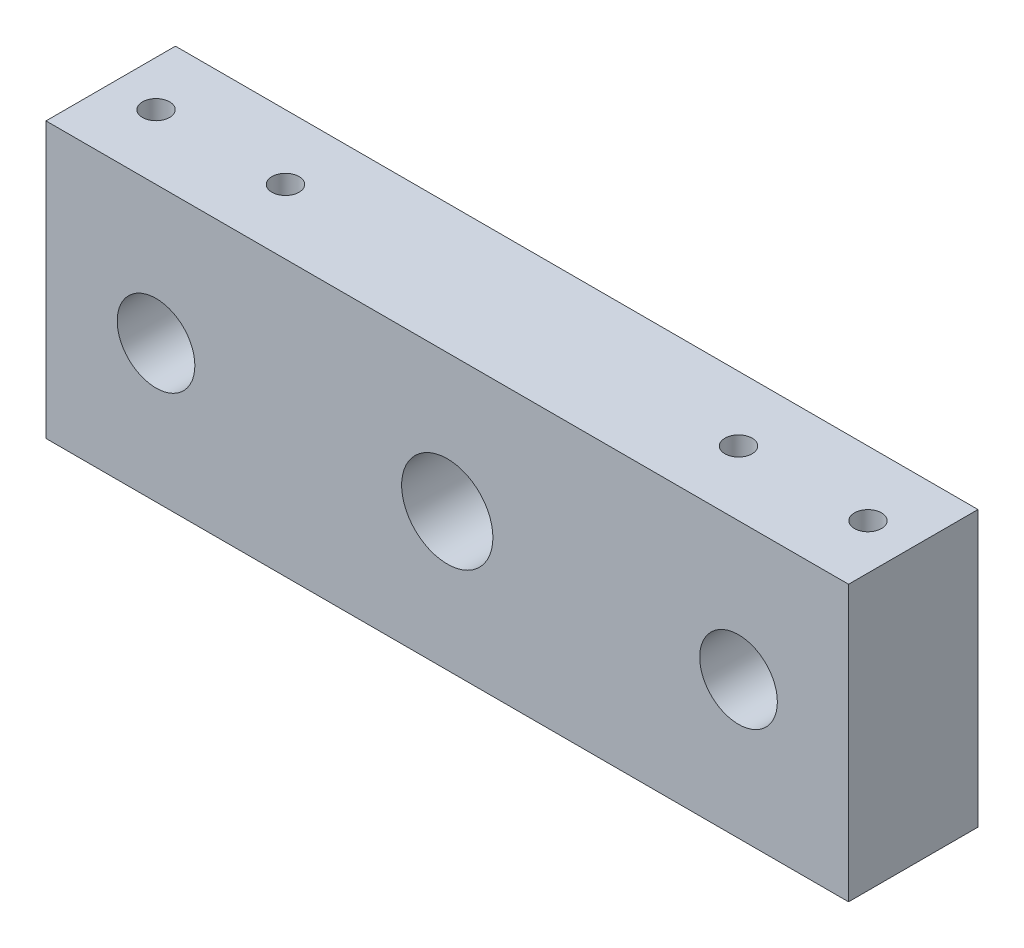
ISO-10303-21;
HEADER;
FILE_DESCRIPTION(('STEP AP214'),'2;1');
FILE_NAME('part.step','',(''),(''),'','','');
FILE_SCHEMA(('AUTOMOTIVE_DESIGN { 1 0 10303 214 1 1 1 1 }'));
ENDSEC;
DATA;
#1=APPLICATION_CONTEXT('core data for automotive mechanical design processes');
#2=APPLICATION_PROTOCOL_DEFINITION('international standard','automotive_design',2000,#1);
#3=PRODUCT_CONTEXT('',#1,'mechanical');
#4=PRODUCT('Part','Part','',(#3));
#5=PRODUCT_RELATED_PRODUCT_CATEGORY('part','',(#4));
#6=PRODUCT_DEFINITION_FORMATION('','',#4);
#7=PRODUCT_DEFINITION_CONTEXT('part definition',#1,'design');
#8=PRODUCT_DEFINITION('design','',#6,#7);
#9=PRODUCT_DEFINITION_SHAPE('','',#8);
#10=(LENGTH_UNIT() NAMED_UNIT(*) SI_UNIT(.MILLI.,.METRE.));
#11=(NAMED_UNIT(*) PLANE_ANGLE_UNIT() SI_UNIT($,.RADIAN.));
#12=(NAMED_UNIT(*) SI_UNIT($,.STERADIAN.) SOLID_ANGLE_UNIT());
#13=UNCERTAINTY_MEASURE_WITH_UNIT(LENGTH_MEASURE(1.E-05),#10,'distance_accuracy_value','');
#14=(GEOMETRIC_REPRESENTATION_CONTEXT(3) GLOBAL_UNCERTAINTY_ASSIGNED_CONTEXT((#13)) GLOBAL_UNIT_ASSIGNED_CONTEXT((#10,
#11,#12)) REPRESENTATION_CONTEXT('',''));
#15=CARTESIAN_POINT('',(0.,0.,0.));
#16=DIRECTION('',(0.,0.,1.));
#17=DIRECTION('',(1.,0.,0.));
#18=AXIS2_PLACEMENT_3D('',#15,#16,#17);
#19=CARTESIAN_POINT('',(0.,0.,20.));
#20=DIRECTION('',(0.,0.,-1.));
#21=DIRECTION('',(-1.,0.,0.));
#22=AXIS2_PLACEMENT_3D('',#19,#20,#21);
#23=PLANE('',#22);
#24=CARTESIAN_POINT('',(62.,21.25,20.));
#25=DIRECTION('',(0.,0.,1.));
#26=DIRECTION('',(1.,0.,0.));
#27=AXIS2_PLACEMENT_3D('',#24,#25,#26);
#28=CIRCLE('',#27,7.05);
#29=CARTESIAN_POINT('',(69.05,21.25,20.));
#30=VERTEX_POINT('',#29);
#31=EDGE_CURVE('E189',#30,#30,#28,.T.);
#32=ORIENTED_EDGE('',*,*,#31,.F.);
#33=EDGE_LOOP('',(#32));
#34=FACE_BOUND('',#33,.T.);
#35=CARTESIAN_POINT('',(107.,21.25,20.));
#36=DIRECTION('',(0.,0.,1.));
#37=DIRECTION('',(1.,0.,0.));
#38=AXIS2_PLACEMENT_3D('',#35,#36,#37);
#39=CIRCLE('',#38,6.);
#40=CARTESIAN_POINT('',(113.,21.25,20.));
#41=VERTEX_POINT('',#40);
#42=EDGE_CURVE('E121',#41,#41,#39,.T.);
#43=ORIENTED_EDGE('',*,*,#42,.F.);
#44=EDGE_LOOP('',(#43));
#45=FACE_BOUND('',#44,.T.);
#46=DIRECTION('',(0.,-1.,0.));
#47=VECTOR('',#46,1.);
#48=CARTESIAN_POINT('',(0.,0.,20.));
#49=LINE('',#48,#47);
#50=CARTESIAN_POINT('',(0.,42.5,20.));
#51=VERTEX_POINT('',#50);
#52=CARTESIAN_POINT('',(0.,0.,20.));
#53=VERTEX_POINT('',#52);
#54=EDGE_CURVE('E90',#51,#53,#49,.T.);
#55=ORIENTED_EDGE('',*,*,#54,.T.);
#56=DIRECTION('',(1.,0.,0.));
#57=VECTOR('',#56,1.);
#58=CARTESIAN_POINT('',(0.,0.,20.));
#59=LINE('',#58,#57);
#60=CARTESIAN_POINT('',(124.,0.,20.));
#61=VERTEX_POINT('',#60);
#62=EDGE_CURVE('E85',#53,#61,#59,.T.);
#63=ORIENTED_EDGE('',*,*,#62,.T.);
#64=DIRECTION('',(0.,1.,0.));
#65=VECTOR('',#64,1.);
#66=CARTESIAN_POINT('',(124.,0.,20.));
#67=LINE('',#66,#65);
#68=CARTESIAN_POINT('',(124.,42.5,20.));
#69=VERTEX_POINT('',#68);
#70=EDGE_CURVE('E88',#61,#69,#67,.T.);
#71=ORIENTED_EDGE('',*,*,#70,.T.);
#72=DIRECTION('',(-1.,0.,0.));
#73=VECTOR('',#72,1.);
#74=CARTESIAN_POINT('',(0.,42.5,20.));
#75=LINE('',#74,#73);
#76=EDGE_CURVE('E55',#69,#51,#75,.T.);
#77=ORIENTED_EDGE('',*,*,#76,.T.);
#78=EDGE_LOOP('',(#55,#63,#71,#77));
#79=FACE_BOUND('',#78,.T.);
#80=CARTESIAN_POINT('',(17.,21.25,20.));
#81=DIRECTION('',(0.,0.,1.));
#82=DIRECTION('',(1.,0.,0.));
#83=AXIS2_PLACEMENT_3D('',#80,#81,#82);
#84=CIRCLE('',#83,6.);
#85=CARTESIAN_POINT('',(23.,21.25,20.));
#86=VERTEX_POINT('',#85);
#87=EDGE_CURVE('E106',#86,#86,#84,.T.);
#88=ORIENTED_EDGE('',*,*,#87,.F.);
#89=EDGE_LOOP('',(#88));
#90=FACE_BOUND('',#89,.T.);
#91=ADVANCED_FACE('F37',(#34,#45,#79,#90),#23,.F.);
#92=CARTESIAN_POINT('',(0.,0.,0.));
#93=DIRECTION('',(0.,0.,-1.));
#94=DIRECTION('',(-1.,0.,0.));
#95=AXIS2_PLACEMENT_3D('',#92,#93,#94);
#96=PLANE('',#95);
#97=CARTESIAN_POINT('',(107.,21.25,0.));
#98=DIRECTION('',(0.,0.,1.));
#99=DIRECTION('',(1.,0.,0.));
#100=AXIS2_PLACEMENT_3D('',#97,#98,#99);
#101=CIRCLE('',#100,6.);
#102=CARTESIAN_POINT('',(113.,21.25,0.));
#103=VERTEX_POINT('',#102);
#104=EDGE_CURVE('E124',#103,#103,#101,.T.);
#105=ORIENTED_EDGE('',*,*,#104,.T.);
#106=EDGE_LOOP('',(#105));
#107=FACE_BOUND('',#106,.T.);
#108=DIRECTION('',(0.,-1.,0.));
#109=VECTOR('',#108,1.);
#110=CARTESIAN_POINT('',(0.,0.,0.));
#111=LINE('',#110,#109);
#112=CARTESIAN_POINT('',(0.,42.5,0.));
#113=VERTEX_POINT('',#112);
#114=CARTESIAN_POINT('',(0.,0.,0.));
#115=VERTEX_POINT('',#114);
#116=EDGE_CURVE('E103',#113,#115,#111,.T.);
#117=ORIENTED_EDGE('',*,*,#116,.F.);
#118=DIRECTION('',(-1.,0.,0.));
#119=VECTOR('',#118,1.);
#120=CARTESIAN_POINT('',(0.,42.5,0.));
#121=LINE('',#120,#119);
#122=CARTESIAN_POINT('',(124.,42.5,0.));
#123=VERTEX_POINT('',#122);
#124=EDGE_CURVE('E78',#123,#113,#121,.T.);
#125=ORIENTED_EDGE('',*,*,#124,.F.);
#126=DIRECTION('',(0.,1.,0.));
#127=VECTOR('',#126,1.);
#128=CARTESIAN_POINT('',(124.,0.,0.));
#129=LINE('',#128,#127);
#130=CARTESIAN_POINT('',(124.,0.,0.));
#131=VERTEX_POINT('',#130);
#132=EDGE_CURVE('E72',#131,#123,#129,.T.);
#133=ORIENTED_EDGE('',*,*,#132,.F.);
#134=DIRECTION('',(1.,0.,0.));
#135=VECTOR('',#134,1.);
#136=CARTESIAN_POINT('',(0.,0.,0.));
#137=LINE('',#136,#135);
#138=EDGE_CURVE('E94',#115,#131,#137,.T.);
#139=ORIENTED_EDGE('',*,*,#138,.F.);
#140=EDGE_LOOP('',(#117,#125,#133,#139));
#141=FACE_BOUND('',#140,.T.);
#142=CARTESIAN_POINT('',(17.,21.25,0.));
#143=DIRECTION('',(0.,0.,1.));
#144=DIRECTION('',(1.,0.,0.));
#145=AXIS2_PLACEMENT_3D('',#142,#143,#144);
#146=CIRCLE('',#145,6.);
#147=CARTESIAN_POINT('',(23.,21.25,0.));
#148=VERTEX_POINT('',#147);
#149=EDGE_CURVE('E118',#148,#148,#146,.T.);
#150=ORIENTED_EDGE('',*,*,#149,.T.);
#151=EDGE_LOOP('',(#150));
#152=FACE_BOUND('',#151,.T.);
#153=CARTESIAN_POINT('',(62.,21.25,0.));
#154=DIRECTION('',(0.,0.,1.));
#155=DIRECTION('',(1.,0.,0.));
#156=AXIS2_PLACEMENT_3D('',#153,#154,#155);
#157=CIRCLE('',#156,5.);
#158=CARTESIAN_POINT('',(67.,21.25,0.));
#159=VERTEX_POINT('',#158);
#160=EDGE_CURVE('E127',#159,#159,#157,.T.);
#161=ORIENTED_EDGE('',*,*,#160,.T.);
#162=EDGE_LOOP('',(#161));
#163=FACE_BOUND('',#162,.T.);
#164=ADVANCED_FACE('F114',(#107,#141,#152,#163),#96,.T.);
#165=CARTESIAN_POINT('',(0.,0.,20.));
#166=DIRECTION('',(1.,0.,0.));
#167=DIRECTION('',(0.,0.,-1.));
#168=AXIS2_PLACEMENT_3D('',#165,#166,#167);
#169=PLANE('',#168);
#170=ORIENTED_EDGE('',*,*,#116,.T.);
#171=DIRECTION('',(0.,0.,-1.));
#172=VECTOR('',#171,1.);
#173=CARTESIAN_POINT('',(0.,0.,20.));
#174=LINE('',#173,#172);
#175=EDGE_CURVE('E12',#53,#115,#174,.T.);
#176=ORIENTED_EDGE('',*,*,#175,.F.);
#177=ORIENTED_EDGE('',*,*,#54,.F.);
#178=DIRECTION('',(0.,0.,-1.));
#179=VECTOR('',#178,1.);
#180=CARTESIAN_POINT('',(0.,42.5,20.));
#181=LINE('',#180,#179);
#182=EDGE_CURVE('E99',#51,#113,#181,.T.);
#183=ORIENTED_EDGE('',*,*,#182,.T.);
#184=EDGE_LOOP('',(#170,#176,#177,#183));
#185=FACE_BOUND('',#184,.T.);
#186=ADVANCED_FACE('F39',(#185),#169,.F.);
#187=CARTESIAN_POINT('',(0.,0.,20.));
#188=DIRECTION('',(0.,1.,0.));
#189=DIRECTION('',(0.,0.,1.));
#190=AXIS2_PLACEMENT_3D('',#187,#188,#189);
#191=PLANE('',#190);
#192=CARTESIAN_POINT('',(107.,0.,10.));
#193=DIRECTION('',(0.,-1.,0.));
#194=DIRECTION('',(0.,0.,-1.));
#195=AXIS2_PLACEMENT_3D('',#192,#193,#194);
#196=CIRCLE('',#195,2.1);
#197=CARTESIAN_POINT('',(107.,0.,7.9));
#198=VERTEX_POINT('',#197);
#199=EDGE_CURVE('E164',#198,#198,#196,.T.);
#200=ORIENTED_EDGE('',*,*,#199,.F.);
#201=EDGE_LOOP('',(#200));
#202=FACE_BOUND('',#201,.T.);
#203=CARTESIAN_POINT('',(17.,0.,10.));
#204=DIRECTION('',(0.,-1.,0.));
#205=DIRECTION('',(0.,0.,-1.));
#206=AXIS2_PLACEMENT_3D('',#203,#204,#205);
#207=CIRCLE('',#206,2.1);
#208=CARTESIAN_POINT('',(17.,0.,7.9));
#209=VERTEX_POINT('',#208);
#210=EDGE_CURVE('E156',#209,#209,#207,.T.);
#211=ORIENTED_EDGE('',*,*,#210,.F.);
#212=EDGE_LOOP('',(#211));
#213=FACE_BOUND('',#212,.T.);
#214=CARTESIAN_POINT('',(117.,0.,10.));
#215=DIRECTION('',(0.,-1.,0.));
#216=DIRECTION('',(0.,0.,-1.));
#217=AXIS2_PLACEMENT_3D('',#214,#215,#216);
#218=CIRCLE('',#217,2.1);
#219=CARTESIAN_POINT('',(117.,0.,7.9));
#220=VERTEX_POINT('',#219);
#221=EDGE_CURVE('E153',#220,#220,#218,.T.);
#222=ORIENTED_EDGE('',*,*,#221,.F.);
#223=EDGE_LOOP('',(#222));
#224=FACE_BOUND('',#223,.T.);
#225=CARTESIAN_POINT('',(97.,0.,10.));
#226=DIRECTION('',(0.,-1.,0.));
#227=DIRECTION('',(0.,0.,-1.));
#228=AXIS2_PLACEMENT_3D('',#225,#226,#227);
#229=CIRCLE('',#228,2.1);
#230=CARTESIAN_POINT('',(97.,0.,7.9));
#231=VERTEX_POINT('',#230);
#232=EDGE_CURVE('E147',#231,#231,#229,.T.);
#233=ORIENTED_EDGE('',*,*,#232,.F.);
#234=EDGE_LOOP('',(#233));
#235=FACE_BOUND('',#234,.T.);
#236=CARTESIAN_POINT('',(27.,0.,10.));
#237=DIRECTION('',(0.,-1.,0.));
#238=DIRECTION('',(0.,0.,-1.));
#239=AXIS2_PLACEMENT_3D('',#236,#237,#238);
#240=CIRCLE('',#239,2.1);
#241=CARTESIAN_POINT('',(27.,0.,7.9));
#242=VERTEX_POINT('',#241);
#243=EDGE_CURVE('E141',#242,#242,#240,.T.);
#244=ORIENTED_EDGE('',*,*,#243,.F.);
#245=EDGE_LOOP('',(#244));
#246=FACE_BOUND('',#245,.T.);
#247=CARTESIAN_POINT('',(7.,0.,10.));
#248=DIRECTION('',(0.,-1.,0.));
#249=DIRECTION('',(0.,0.,-1.));
#250=AXIS2_PLACEMENT_3D('',#247,#248,#249);
#251=CIRCLE('',#250,2.1);
#252=CARTESIAN_POINT('',(7.,0.,7.9));
#253=VERTEX_POINT('',#252);
#254=EDGE_CURVE('E135',#253,#253,#251,.T.);
#255=ORIENTED_EDGE('',*,*,#254,.F.);
#256=EDGE_LOOP('',(#255));
#257=FACE_BOUND('',#256,.T.);
#258=ORIENTED_EDGE('',*,*,#138,.T.);
#259=DIRECTION('',(0.,0.,-1.));
#260=VECTOR('',#259,1.);
#261=CARTESIAN_POINT('',(124.,0.,20.));
#262=LINE('',#261,#260);
#263=EDGE_CURVE('E47',#61,#131,#262,.T.);
#264=ORIENTED_EDGE('',*,*,#263,.F.);
#265=ORIENTED_EDGE('',*,*,#62,.F.);
#266=ORIENTED_EDGE('',*,*,#175,.T.);
#267=EDGE_LOOP('',(#258,#264,#265,#266));
#268=FACE_BOUND('',#267,.T.);
#269=ADVANCED_FACE('F93',(#202,#213,#224,#235,#246,#257,#268),#191,.F.);
#270=CARTESIAN_POINT('',(124.,0.,20.));
#271=DIRECTION('',(-1.,0.,0.));
#272=DIRECTION('',(0.,0.,1.));
#273=AXIS2_PLACEMENT_3D('',#270,#271,#272);
#274=PLANE('',#273);
#275=ORIENTED_EDGE('',*,*,#132,.T.);
#276=DIRECTION('',(0.,0.,-1.));
#277=VECTOR('',#276,1.);
#278=CARTESIAN_POINT('',(124.,42.5,20.));
#279=LINE('',#278,#277);
#280=EDGE_CURVE('E95',#69,#123,#279,.T.);
#281=ORIENTED_EDGE('',*,*,#280,.F.);
#282=ORIENTED_EDGE('',*,*,#70,.F.);
#283=ORIENTED_EDGE('',*,*,#263,.T.);
#284=EDGE_LOOP('',(#275,#281,#282,#283));
#285=FACE_BOUND('',#284,.T.);
#286=ADVANCED_FACE('F97',(#285),#274,.F.);
#287=CARTESIAN_POINT('',(0.,42.5,20.));
#288=DIRECTION('',(0.,-1.,0.));
#289=DIRECTION('',(0.,0.,-1.));
#290=AXIS2_PLACEMENT_3D('',#287,#288,#289);
#291=PLANE('',#290);
#292=CARTESIAN_POINT('',(117.,42.5,10.));
#293=DIRECTION('',(0.,-1.,0.));
#294=DIRECTION('',(0.,0.,-1.));
#295=AXIS2_PLACEMENT_3D('',#292,#293,#294);
#296=CIRCLE('',#295,2.1);
#297=CARTESIAN_POINT('',(117.,42.5,7.9));
#298=VERTEX_POINT('',#297);
#299=EDGE_CURVE('E150',#298,#298,#296,.F.);
#300=ORIENTED_EDGE('',*,*,#299,.F.);
#301=EDGE_LOOP('',(#300));
#302=FACE_BOUND('',#301,.T.);
#303=CARTESIAN_POINT('',(97.,42.5,10.));
#304=DIRECTION('',(0.,-1.,0.));
#305=DIRECTION('',(0.,0.,-1.));
#306=AXIS2_PLACEMENT_3D('',#303,#304,#305);
#307=CIRCLE('',#306,2.1);
#308=CARTESIAN_POINT('',(97.,42.5,7.9));
#309=VERTEX_POINT('',#308);
#310=EDGE_CURVE('E144',#309,#309,#307,.F.);
#311=ORIENTED_EDGE('',*,*,#310,.F.);
#312=EDGE_LOOP('',(#311));
#313=FACE_BOUND('',#312,.T.);
#314=CARTESIAN_POINT('',(27.,42.5,10.));
#315=DIRECTION('',(0.,-1.,0.));
#316=DIRECTION('',(0.,0.,-1.));
#317=AXIS2_PLACEMENT_3D('',#314,#315,#316);
#318=CIRCLE('',#317,2.1);
#319=CARTESIAN_POINT('',(27.,42.5,7.9));
#320=VERTEX_POINT('',#319);
#321=EDGE_CURVE('E138',#320,#320,#318,.F.);
#322=ORIENTED_EDGE('',*,*,#321,.F.);
#323=EDGE_LOOP('',(#322));
#324=FACE_BOUND('',#323,.T.);
#325=CARTESIAN_POINT('',(7.,42.5,10.));
#326=DIRECTION('',(0.,-1.,0.));
#327=DIRECTION('',(0.,0.,-1.));
#328=AXIS2_PLACEMENT_3D('',#325,#326,#327);
#329=CIRCLE('',#328,2.1);
#330=CARTESIAN_POINT('',(7.,42.5,7.9));
#331=VERTEX_POINT('',#330);
#332=EDGE_CURVE('E132',#331,#331,#329,.F.);
#333=ORIENTED_EDGE('',*,*,#332,.F.);
#334=EDGE_LOOP('',(#333));
#335=FACE_BOUND('',#334,.T.);
#336=ORIENTED_EDGE('',*,*,#124,.T.);
#337=ORIENTED_EDGE('',*,*,#182,.F.);
#338=ORIENTED_EDGE('',*,*,#76,.F.);
#339=ORIENTED_EDGE('',*,*,#280,.T.);
#340=EDGE_LOOP('',(#336,#337,#338,#339));
#341=FACE_BOUND('',#340,.T.);
#342=ADVANCED_FACE('F111',(#302,#313,#324,#335,#341),#291,.F.);
#343=CARTESIAN_POINT('',(17.,21.25,20.));
#344=DIRECTION('',(0.,0.,-1.));
#345=DIRECTION('',(-1.,0.,0.));
#346=AXIS2_PLACEMENT_3D('',#343,#344,#345);
#347=CYLINDRICAL_SURFACE('',#346,6.);
#348=CARTESIAN_POINT('',(17.,15.25,7.9));
#349=CARTESIAN_POINT('',(17.1142516194006,15.2499987552028,7.89999822601036));
#350=CARTESIAN_POINT('',(17.2284905729634,15.2532928132771,7.90935380284321));
#351=CARTESIAN_POINT('',(17.4535840155013,15.2661072744988,7.94640027589731));
#352=CARTESIAN_POINT('',(17.5644384893696,15.2756277054337,7.97409125394709));
#353=CARTESIAN_POINT('',(17.7794854136097,15.2998652384658,8.04672936310118));
#354=CARTESIAN_POINT('',(17.8836892962548,15.3145731228161,8.09164589786341));
#355=CARTESIAN_POINT('',(18.0830819871769,15.3476986016113,8.19731506675841));
#356=CARTESIAN_POINT('',(18.1782687394779,15.3661170391124,8.25807130067396));
#357=CARTESIAN_POINT('',(18.360515535232,15.4055162958381,8.39609710939043));
#358=CARTESIAN_POINT('',(18.4471891788562,15.4265629493377,8.47385795093347));
#359=CARTESIAN_POINT('',(18.6065671109076,15.4684996303362,8.64264200136844));
#360=CARTESIAN_POINT('',(18.6792678852381,15.4893896171682,8.73366853641225));
#361=CARTESIAN_POINT('',(18.8109377386165,15.5293878747203,8.9299927897352));
#362=CARTESIAN_POINT('',(18.8693877983697,15.5484168632785,9.03565633507553));
#363=CARTESIAN_POINT('',(18.9675195937071,15.5815285339265,9.25608675417473));
#364=CARTESIAN_POINT('',(19.0072077327117,15.595612903186,9.37085050640565));
#365=CARTESIAN_POINT('',(19.0652098359655,15.616543381873,9.601805819609));
#366=CARTESIAN_POINT('',(19.0842534029273,15.6236357035759,9.71779113828172));
#367=CARTESIAN_POINT('',(19.1027071866432,15.6305045687387,9.9515110713519));
#368=CARTESIAN_POINT('',(19.1021242259244,15.6302836544089,10.0692450636545));
#369=CARTESIAN_POINT('',(19.0819045994042,15.6227654389568,10.2967296753296));
#370=CARTESIAN_POINT('',(19.0632422906149,15.6158300173739,10.4065809881685));
#371=CARTESIAN_POINT('',(19.008991449874,15.5962599726946,10.6214814437746));
#372=CARTESIAN_POINT('',(18.9734006946836,15.5836246010262,10.7265299537955));
#373=CARTESIAN_POINT('',(18.885706226554,15.5538363357319,10.9309674200672));
#374=CARTESIAN_POINT('',(18.8333279926783,15.536609204466,11.0302273308091));
#375=CARTESIAN_POINT('',(18.7137361310181,15.499607122686,11.2188471693909));
#376=CARTESIAN_POINT('',(18.6465178767362,15.479831378423,11.3082039967864));
#377=CARTESIAN_POINT('',(18.4945603971118,15.4385605521253,11.4799259370217));
#378=CARTESIAN_POINT('',(18.4090316470524,15.4170322405348,11.5615859497292));
#379=CARTESIAN_POINT('',(18.2252341083534,15.3756775551746,11.7095979231335));
#380=CARTESIAN_POINT('',(18.126963836302,15.3558513800209,11.7759480989024));
#381=CARTESIAN_POINT('',(17.9188608374711,15.3198261198028,11.8921035947525));
#382=CARTESIAN_POINT('',(17.8089042820462,15.3036730720327,11.9417023374671));
#383=CARTESIAN_POINT('',(17.5815050857846,15.2771507058782,12.0214733841199));
#384=CARTESIAN_POINT('',(17.4640653433021,15.2667791632185,12.051653159663));
#385=CARTESIAN_POINT('',(17.2309892262088,15.2533656390229,12.0904394880531));
#386=CARTESIAN_POINT('',(17.1155295791762,15.2500006650074,12.0999974839114));
#387=CARTESIAN_POINT('',(16.8846221081369,15.2499993358211,12.1000025136053));
#388=CARTESIAN_POINT('',(16.7691742860102,15.2533617111489,12.0904531531422));
#389=CARTESIAN_POINT('',(16.5454926231719,15.2662238060776,12.0532567900578));
#390=CARTESIAN_POINT('',(16.4371462835607,15.2755202150541,12.0262089173599));
#391=CARTESIAN_POINT('',(16.2265849734939,15.2991124593445,11.9555477110597));
#392=CARTESIAN_POINT('',(16.1243707983808,15.3134089415332,11.9119322339925));
#393=CARTESIAN_POINT('',(15.9258159232364,15.3460574482739,11.8080459468211));
#394=CARTESIAN_POINT('',(15.8297160552353,15.3645107594108,11.7473476091779));
#395=CARTESIAN_POINT('',(15.6487653274498,15.4033988951979,11.6115128922561));
#396=CARTESIAN_POINT('',(15.5639182185644,15.4238343766575,11.5363717190656));
#397=CARTESIAN_POINT('',(15.4034281077176,15.4656949616548,11.3693198790316));
#398=CARTESIAN_POINT('',(15.3284632930293,15.4871181065125,11.2767555352139));
#399=CARTESIAN_POINT('',(15.1950275442456,15.5275049278558,11.0799124603601));
#400=CARTESIAN_POINT('',(15.136557188856,15.5464685180357,10.9756333184915));
#401=CARTESIAN_POINT('',(15.0379341111245,15.5796366703032,10.7579996258755));
#402=CARTESIAN_POINT('',(14.9977817616066,15.5938411355274,10.644644890469));
#403=CARTESIAN_POINT('',(14.9373490028753,15.6155947476115,10.4121607276682));
#404=CARTESIAN_POINT('',(14.9170583971797,15.6231473091789,10.2930342963081));
#405=CARTESIAN_POINT('',(14.8977683642258,15.6303276337806,10.0596278070747));
#406=CARTESIAN_POINT('',(14.8976316153156,15.6303787191931,9.94545382198878));
#407=CARTESIAN_POINT('',(14.9158093998629,15.6236120389952,9.71880242610544));
#408=CARTESIAN_POINT('',(14.9341226076329,15.6167947668979,9.60632489400189));
#409=CARTESIAN_POINT('',(14.9878420811691,15.5973898359466,9.3888694247543));
#410=CARTESIAN_POINT('',(15.0228433656675,15.5849392327477,9.28377821999172));
#411=CARTESIAN_POINT('',(15.1086072825281,15.555733062027,9.08088514311585));
#412=CARTESIAN_POINT('',(15.1593736239364,15.5389764815979,8.98308499309107));
#413=CARTESIAN_POINT('',(15.2780178758084,15.5020607458532,8.79253925476462));
#414=CARTESIAN_POINT('',(15.3465905556578,15.4817782900399,8.70025035987912));
#415=CARTESIAN_POINT('',(15.4977655931956,15.4405746312001,8.52812342278989));
#416=CARTESIAN_POINT('',(15.5803721081357,15.4196532404122,8.44828908348879));
#417=CARTESIAN_POINT('',(15.7616881009779,15.3784079828369,8.29972973097157));
#418=CARTESIAN_POINT('',(15.8609516128231,15.3581524265817,8.23165932969433));
#419=CARTESIAN_POINT('',(16.07019942255,15.3215318429706,8.11322590283225));
#420=CARTESIAN_POINT('',(16.180182298082,15.3051663004379,8.06286053204577));
#421=CARTESIAN_POINT('',(16.406582097364,15.278342313901,7.98204566857529));
#422=CARTESIAN_POINT('',(16.5229162722481,15.267821709516,7.95138603485794));
#423=CARTESIAN_POINT('',(16.7595059050368,15.2536524177038,7.91036770899691));
#424=CARTESIAN_POINT('',(16.8797599667059,15.2500013100423,7.90000186697199));
#425=CARTESIAN_POINT('',(17.,15.25,7.9));
#426=B_SPLINE_CURVE_WITH_KNOTS('',3,(#348,#349,#350,#351,#352,#353,#354,#355,#356,#357,#358,
#359,#360,#361,#362,#363,#364,#365,#366,#367,#368,#369,#370,#371,#372,#373,#374,#375,#376,#377,
#378,#379,#380,#381,#382,#383,#384,#385,#386,#387,#388,#389,#390,#391,#392,#393,#394,#395,#396,
#397,#398,#399,#400,#401,#402,#403,#404,#405,#406,#407,#408,#409,#410,#411,#412,#413,#414,#415,
#416,#417,#418,#419,#420,#421,#422,#423,#424,#425),.UNSPECIFIED.,.T.,.F.,(4,2,2,2,2,2,2,2,2,2,2,
2,2,2,2,2,2,2,2,2,2,2,2,2,2,2,2,2,2,2,2,2,2,2,2,2,2,2,4),(0.,0.342311966418852,
0.684625460541927,1.0263337265292,1.36811971807276,1.72152774061768,2.07502452728512,
2.43993230688261,2.80471545382672,3.15613820349785,3.50743879368812,3.8408028032104,
4.17421060603092,4.51337542799159,4.85264613704544,5.21157468826313,5.57054506475927,
5.93379308543943,6.29690125979621,6.64286253258121,6.98875852603918,7.32339682261911,
7.65807842841235,8.00202226625167,8.3460804647883,8.70745545379963,9.06884312002098,
9.43023814118973,9.79144753447262,10.1322648947517,10.4730577679759,10.8059714961508,
11.1389636083741,11.4876784253319,11.8364967229958,12.2008786824211,12.565212357747,
12.925593343809,13.2858473380639),.UNSPECIFIED.);
#427=CARTESIAN_POINT('',(17.,15.25,7.9));
#428=VERTEX_POINT('',#427);
#429=EDGE_CURVE('E157',#428,#428,#426,.T.);
#430=ORIENTED_EDGE('',*,*,#429,.T.);
#431=EDGE_LOOP('',(#430));
#432=FACE_BOUND('',#431,.T.);
#433=ORIENTED_EDGE('',*,*,#87,.T.);
#434=EDGE_LOOP('',(#433));
#435=FACE_BOUND('',#434,.T.);
#436=ORIENTED_EDGE('',*,*,#149,.F.);
#437=EDGE_LOOP('',(#436));
#438=FACE_BOUND('',#437,.T.);
#439=ADVANCED_FACE('F205',(#432,#435,#438),#347,.F.);
#440=CARTESIAN_POINT('',(107.,21.25,20.));
#441=DIRECTION('',(0.,0.,-1.));
#442=DIRECTION('',(-1.,0.,0.));
#443=AXIS2_PLACEMENT_3D('',#440,#441,#442);
#444=CYLINDRICAL_SURFACE('',#443,6.);
#445=CARTESIAN_POINT('',(107.,15.25,7.9));
#446=CARTESIAN_POINT('',(107.114251619401,15.2499987552028,7.89999822601036));
#447=CARTESIAN_POINT('',(107.228490572963,15.2532928132771,7.90935380284321));
#448=CARTESIAN_POINT('',(107.453584015501,15.2661072744988,7.94640027589731));
#449=CARTESIAN_POINT('',(107.56443848937,15.2756277054337,7.97409125394709));
#450=CARTESIAN_POINT('',(107.77948541361,15.2998652384658,8.04672936310118));
#451=CARTESIAN_POINT('',(107.883689296255,15.3145731228161,8.09164589786341));
#452=CARTESIAN_POINT('',(108.083081987177,15.3476986016113,8.19731506675842));
#453=CARTESIAN_POINT('',(108.178268739478,15.3661170391124,8.25807130067396));
#454=CARTESIAN_POINT('',(108.360515535232,15.4055162958381,8.39609710939044));
#455=CARTESIAN_POINT('',(108.447189178856,15.4265629493377,8.47385795093347));
#456=CARTESIAN_POINT('',(108.606567110908,15.4684996303362,8.64264200136844));
#457=CARTESIAN_POINT('',(108.679267885238,15.4893896171682,8.73366853641226));
#458=CARTESIAN_POINT('',(108.810937738617,15.5293878747203,8.92999278973521));
#459=CARTESIAN_POINT('',(108.86938779837,15.5484168632785,9.03565633507553));
#460=CARTESIAN_POINT('',(108.967519593707,15.5815285339266,9.25608675417473));
#461=CARTESIAN_POINT('',(109.007207732712,15.595612903186,9.37085050640566));
#462=CARTESIAN_POINT('',(109.065209835966,15.616543381873,9.60180581960901));
#463=CARTESIAN_POINT('',(109.084253402927,15.6236357035759,9.71779113828173));
#464=CARTESIAN_POINT('',(109.102707186643,15.6305045687387,9.95151107135191));
#465=CARTESIAN_POINT('',(109.102124225924,15.6302836544089,10.0692450636545));
#466=CARTESIAN_POINT('',(109.081904599404,15.6227654389568,10.2967296753296));
#467=CARTESIAN_POINT('',(109.063242290615,15.6158300173739,10.4065809881685));
#468=CARTESIAN_POINT('',(109.008991449874,15.5962599726946,10.6214814437746));
#469=CARTESIAN_POINT('',(108.973400694684,15.5836246010262,10.7265299537955));
#470=CARTESIAN_POINT('',(108.885706226554,15.5538363357319,10.9309674200672));
#471=CARTESIAN_POINT('',(108.833327992678,15.536609204466,11.0302273308091));
#472=CARTESIAN_POINT('',(108.713736131018,15.499607122686,11.2188471693909));
#473=CARTESIAN_POINT('',(108.646517876736,15.479831378423,11.3082039967864));
#474=CARTESIAN_POINT('',(108.494560397112,15.4385605521253,11.4799259370217));
#475=CARTESIAN_POINT('',(108.409031647052,15.4170322405348,11.5615859497292));
#476=CARTESIAN_POINT('',(108.225234108353,15.3756775551746,11.7095979231335));
#477=CARTESIAN_POINT('',(108.126963836302,15.3558513800209,11.7759480989024));
#478=CARTESIAN_POINT('',(107.918860837471,15.3198261198028,11.8921035947525));
#479=CARTESIAN_POINT('',(107.808904282046,15.3036730720327,11.9417023374671));
#480=CARTESIAN_POINT('',(107.581505085785,15.2771507058782,12.0214733841199));
#481=CARTESIAN_POINT('',(107.464065343302,15.2667791632185,12.051653159663));
#482=CARTESIAN_POINT('',(107.230989226209,15.2533656390228,12.0904394880531));
#483=CARTESIAN_POINT('',(107.115529579176,15.2500006650074,12.0999974839114));
#484=CARTESIAN_POINT('',(106.884622108137,15.2499993358211,12.1000025136053));
#485=CARTESIAN_POINT('',(106.76917428601,15.2533617111489,12.0904531531422));
#486=CARTESIAN_POINT('',(106.545492623172,15.2662238060776,12.0532567900578));
#487=CARTESIAN_POINT('',(106.437146283561,15.2755202150541,12.0262089173599));
#488=CARTESIAN_POINT('',(106.226584973494,15.2991124593445,11.9555477110597));
#489=CARTESIAN_POINT('',(106.124370798381,15.3134089415332,11.9119322339925));
#490=CARTESIAN_POINT('',(105.925815923236,15.3460574482739,11.8080459468211));
#491=CARTESIAN_POINT('',(105.829716055235,15.3645107594108,11.7473476091779));
#492=CARTESIAN_POINT('',(105.64876532745,15.4033988951979,11.6115128922561));
#493=CARTESIAN_POINT('',(105.563918218564,15.4238343766575,11.5363717190656));
#494=CARTESIAN_POINT('',(105.403428107718,15.4656949616548,11.3693198790316));
#495=CARTESIAN_POINT('',(105.328463293029,15.4871181065125,11.2767555352139));
#496=CARTESIAN_POINT('',(105.195027544246,15.5275049278558,11.0799124603601));
#497=CARTESIAN_POINT('',(105.136557188856,15.5464685180357,10.9756333184915));
#498=CARTESIAN_POINT('',(105.037934111124,15.5796366703032,10.7579996258755));
#499=CARTESIAN_POINT('',(104.997781761607,15.5938411355274,10.644644890469));
#500=CARTESIAN_POINT('',(104.937349002875,15.6155947476115,10.4121607276682));
#501=CARTESIAN_POINT('',(104.91705839718,15.6231473091789,10.2930342963081));
#502=CARTESIAN_POINT('',(104.897768364226,15.6303276337806,10.0596278070747));
#503=CARTESIAN_POINT('',(104.897631615316,15.6303787191931,9.94545382198877));
#504=CARTESIAN_POINT('',(104.915809399863,15.6236120389952,9.71880242610543));
#505=CARTESIAN_POINT('',(104.934122607633,15.6167947668979,9.60632489400187));
#506=CARTESIAN_POINT('',(104.987842081169,15.5973898359466,9.38886942475429));
#507=CARTESIAN_POINT('',(105.022843365667,15.5849392327477,9.28377821999171));
#508=CARTESIAN_POINT('',(105.108607282528,15.555733062027,9.08088514311584));
#509=CARTESIAN_POINT('',(105.159373623936,15.5389764815979,8.98308499309106));
#510=CARTESIAN_POINT('',(105.278017875808,15.5020607458531,8.79253925476461));
#511=CARTESIAN_POINT('',(105.346590555658,15.4817782900399,8.70025035987911));
#512=CARTESIAN_POINT('',(105.497765593196,15.4405746312001,8.52812342278988));
#513=CARTESIAN_POINT('',(105.580372108136,15.4196532404122,8.44828908348878));
#514=CARTESIAN_POINT('',(105.761688100978,15.3784079828369,8.29972973097157));
#515=CARTESIAN_POINT('',(105.860951612823,15.3581524265817,8.23165932969433));
#516=CARTESIAN_POINT('',(106.07019942255,15.3215318429706,8.11322590283224));
#517=CARTESIAN_POINT('',(106.180182298082,15.3051663004379,8.06286053204576));
#518=CARTESIAN_POINT('',(106.406582097364,15.278342313901,7.98204566857529));
#519=CARTESIAN_POINT('',(106.522916272248,15.267821709516,7.95138603485794));
#520=CARTESIAN_POINT('',(106.759505905037,15.2536524177038,7.91036770899691));
#521=CARTESIAN_POINT('',(106.879759966706,15.2500013100423,7.90000186697198));
#522=CARTESIAN_POINT('',(107.,15.25,7.9));
#523=B_SPLINE_CURVE_WITH_KNOTS('',3,(#445,#446,#447,#448,#449,#450,#451,#452,#453,#454,#455,
#456,#457,#458,#459,#460,#461,#462,#463,#464,#465,#466,#467,#468,#469,#470,#471,#472,#473,#474,
#475,#476,#477,#478,#479,#480,#481,#482,#483,#484,#485,#486,#487,#488,#489,#490,#491,#492,#493,
#494,#495,#496,#497,#498,#499,#500,#501,#502,#503,#504,#505,#506,#507,#508,#509,#510,#511,#512,
#513,#514,#515,#516,#517,#518,#519,#520,#521,#522),.UNSPECIFIED.,.T.,.F.,(4,2,2,2,2,2,2,2,2,2,2,
2,2,2,2,2,2,2,2,2,2,2,2,2,2,2,2,2,2,2,2,2,2,2,2,2,2,2,4),(0.,0.342311966418849,
0.684625460541934,1.0263337265292,1.36811971807276,1.72152774061769,2.07502452728513,
2.43993230688262,2.80471545382674,3.15613820349786,3.50743879368814,3.84080280321042,
4.17421060603094,4.5133754279916,4.85264613704546,5.21157468826314,5.57054506475928,
5.93379308543946,6.29690125979622,6.64286253258121,6.98875852603918,7.32339682261912,
7.65807842841236,8.00202226625168,8.34608046478832,8.70745545379966,9.06884312002101,
9.43023814118976,9.79144753447264,10.1322648947517,10.4730577679759,10.8059714961508,
11.1389636083741,11.4876784253319,11.8364967229958,12.2008786824211,12.565212357747,
12.925593343809,13.2858473380639),.UNSPECIFIED.);
#524=CARTESIAN_POINT('',(107.,15.25,7.9));
#525=VERTEX_POINT('',#524);
#526=EDGE_CURVE('E179',#525,#525,#523,.T.);
#527=ORIENTED_EDGE('',*,*,#526,.T.);
#528=EDGE_LOOP('',(#527));
#529=FACE_BOUND('',#528,.T.);
#530=ORIENTED_EDGE('',*,*,#42,.T.);
#531=EDGE_LOOP('',(#530));
#532=FACE_BOUND('',#531,.T.);
#533=ORIENTED_EDGE('',*,*,#104,.F.);
#534=EDGE_LOOP('',(#533));
#535=FACE_BOUND('',#534,.T.);
#536=ADVANCED_FACE('F201',(#529,#532,#535),#444,.F.);
#537=CARTESIAN_POINT('',(62.,21.25,20.));
#538=DIRECTION('',(0.,0.,-1.));
#539=DIRECTION('',(-1.,0.,0.));
#540=AXIS2_PLACEMENT_3D('',#537,#538,#539);
#541=CYLINDRICAL_SURFACE('',#540,5.);
#542=CARTESIAN_POINT('',(62.,21.25,4.));
#543=DIRECTION('',(0.,0.,-1.));
#544=DIRECTION('',(-1.,0.,0.));
#545=AXIS2_PLACEMENT_3D('',#542,#543,#544);
#546=CIRCLE('',#545,5.);
#547=CARTESIAN_POINT('',(57.,21.25,4.));
#548=VERTEX_POINT('',#547);
#549=EDGE_CURVE('E41',#548,#548,#546,.T.);
#550=ORIENTED_EDGE('',*,*,#549,.F.);
#551=EDGE_LOOP('',(#550));
#552=FACE_BOUND('',#551,.T.);
#553=ORIENTED_EDGE('',*,*,#160,.F.);
#554=EDGE_LOOP('',(#553));
#555=FACE_BOUND('',#554,.T.);
#556=ADVANCED_FACE('F204',(#552,#555),#541,.F.);
#557=CARTESIAN_POINT('',(7.,42.501,10.));
#558=DIRECTION('',(0.,-1.,0.));
#559=DIRECTION('',(0.,0.,-1.));
#560=AXIS2_PLACEMENT_3D('',#557,#558,#559);
#561=CYLINDRICAL_SURFACE('',#560,2.1);
#562=ORIENTED_EDGE('',*,*,#254,.T.);
#563=EDGE_LOOP('',(#562));
#564=FACE_BOUND('',#563,.T.);
#565=ORIENTED_EDGE('',*,*,#332,.T.);
#566=EDGE_LOOP('',(#565));
#567=FACE_BOUND('',#566,.T.);
#568=ADVANCED_FACE('F238',(#564,#567),#561,.F.);
#569=CARTESIAN_POINT('',(27.,42.501,10.));
#570=DIRECTION('',(0.,-1.,0.));
#571=DIRECTION('',(0.,0.,-1.));
#572=AXIS2_PLACEMENT_3D('',#569,#570,#571);
#573=CYLINDRICAL_SURFACE('',#572,2.1);
#574=ORIENTED_EDGE('',*,*,#243,.T.);
#575=EDGE_LOOP('',(#574));
#576=FACE_BOUND('',#575,.T.);
#577=ORIENTED_EDGE('',*,*,#321,.T.);
#578=EDGE_LOOP('',(#577));
#579=FACE_BOUND('',#578,.T.);
#580=ADVANCED_FACE('F241',(#576,#579),#573,.F.);
#581=CARTESIAN_POINT('',(97.,42.501,10.));
#582=DIRECTION('',(0.,-1.,0.));
#583=DIRECTION('',(0.,0.,-1.));
#584=AXIS2_PLACEMENT_3D('',#581,#582,#583);
#585=CYLINDRICAL_SURFACE('',#584,2.1);
#586=ORIENTED_EDGE('',*,*,#232,.T.);
#587=EDGE_LOOP('',(#586));
#588=FACE_BOUND('',#587,.T.);
#589=ORIENTED_EDGE('',*,*,#310,.T.);
#590=EDGE_LOOP('',(#589));
#591=FACE_BOUND('',#590,.T.);
#592=ADVANCED_FACE('F249',(#588,#591),#585,.F.);
#593=CARTESIAN_POINT('',(117.,42.501,10.));
#594=DIRECTION('',(0.,-1.,0.));
#595=DIRECTION('',(0.,0.,-1.));
#596=AXIS2_PLACEMENT_3D('',#593,#594,#595);
#597=CYLINDRICAL_SURFACE('',#596,2.1);
#598=ORIENTED_EDGE('',*,*,#221,.T.);
#599=EDGE_LOOP('',(#598));
#600=FACE_BOUND('',#599,.T.);
#601=ORIENTED_EDGE('',*,*,#299,.T.);
#602=EDGE_LOOP('',(#601));
#603=FACE_BOUND('',#602,.T.);
#604=ADVANCED_FACE('F270',(#600,#603),#597,.F.);
#605=CARTESIAN_POINT('',(17.,42.501,10.));
#606=DIRECTION('',(0.,-1.,0.));
#607=DIRECTION('',(0.,0.,-1.));
#608=AXIS2_PLACEMENT_3D('',#605,#606,#607);
#609=CYLINDRICAL_SURFACE('',#608,2.1);
#610=ORIENTED_EDGE('',*,*,#429,.F.);
#611=EDGE_LOOP('',(#610));
#612=FACE_BOUND('',#611,.T.);
#613=ORIENTED_EDGE('',*,*,#210,.T.);
#614=EDGE_LOOP('',(#613));
#615=FACE_BOUND('',#614,.T.);
#616=ADVANCED_FACE('F166',(#612,#615),#609,.F.);
#617=CARTESIAN_POINT('',(107.,42.501,10.));
#618=DIRECTION('',(0.,-1.,0.));
#619=DIRECTION('',(0.,0.,-1.));
#620=AXIS2_PLACEMENT_3D('',#617,#618,#619);
#621=CYLINDRICAL_SURFACE('',#620,2.1);
#622=ORIENTED_EDGE('',*,*,#526,.F.);
#623=EDGE_LOOP('',(#622));
#624=FACE_BOUND('',#623,.T.);
#625=ORIENTED_EDGE('',*,*,#199,.T.);
#626=EDGE_LOOP('',(#625));
#627=FACE_BOUND('',#626,.T.);
#628=ADVANCED_FACE('F171',(#624,#627),#621,.F.);
#629=CARTESIAN_POINT('',(0.,0.,4.));
#630=DIRECTION('',(0.,0.,-1.));
#631=DIRECTION('',(-1.,0.,0.));
#632=AXIS2_PLACEMENT_3D('',#629,#630,#631);
#633=PLANE('',#632);
#634=ORIENTED_EDGE('',*,*,#549,.T.);
#635=EDGE_LOOP('',(#634));
#636=FACE_BOUND('',#635,.T.);
#637=CARTESIAN_POINT('',(62.,21.25,4.));
#638=DIRECTION('',(0.,0.,-1.));
#639=DIRECTION('',(-1.,0.,0.));
#640=AXIS2_PLACEMENT_3D('',#637,#638,#639);
#641=CIRCLE('',#640,7.05);
#642=CARTESIAN_POINT('',(54.95,21.25,4.));
#643=VERTEX_POINT('',#642);
#644=EDGE_CURVE('E186',#643,#643,#641,.F.);
#645=ORIENTED_EDGE('',*,*,#644,.T.);
#646=EDGE_LOOP('',(#645));
#647=FACE_BOUND('',#646,.T.);
#648=ADVANCED_FACE('F175',(#636,#647),#633,.F.);
#649=CARTESIAN_POINT('',(62.,21.25,-19.9404112294606));
#650=DIRECTION('',(0.,0.,1.));
#651=DIRECTION('',(1.,0.,0.));
#652=AXIS2_PLACEMENT_3D('',#649,#650,#651);
#653=CYLINDRICAL_SURFACE('',#652,7.05);
#654=ORIENTED_EDGE('',*,*,#31,.T.);
#655=EDGE_LOOP('',(#654));
#656=FACE_BOUND('',#655,.T.);
#657=ORIENTED_EDGE('',*,*,#644,.F.);
#658=EDGE_LOOP('',(#657));
#659=FACE_BOUND('',#658,.T.);
#660=ADVANCED_FACE('F193',(#656,#659),#653,.F.);
#661=CLOSED_SHELL('',(#91,#164,#186,#269,#286,#342,#439,#536,#556,#568,#580,#592,#604,#616,#628,
#648,#660));
#662=MANIFOLD_SOLID_BREP('B2',#661);
#663=ADVANCED_BREP_SHAPE_REPRESENTATION('',(#18,#662),#14);
#664=SHAPE_DEFINITION_REPRESENTATION(#9,#663);
ENDSEC;
END-ISO-10303-21;
